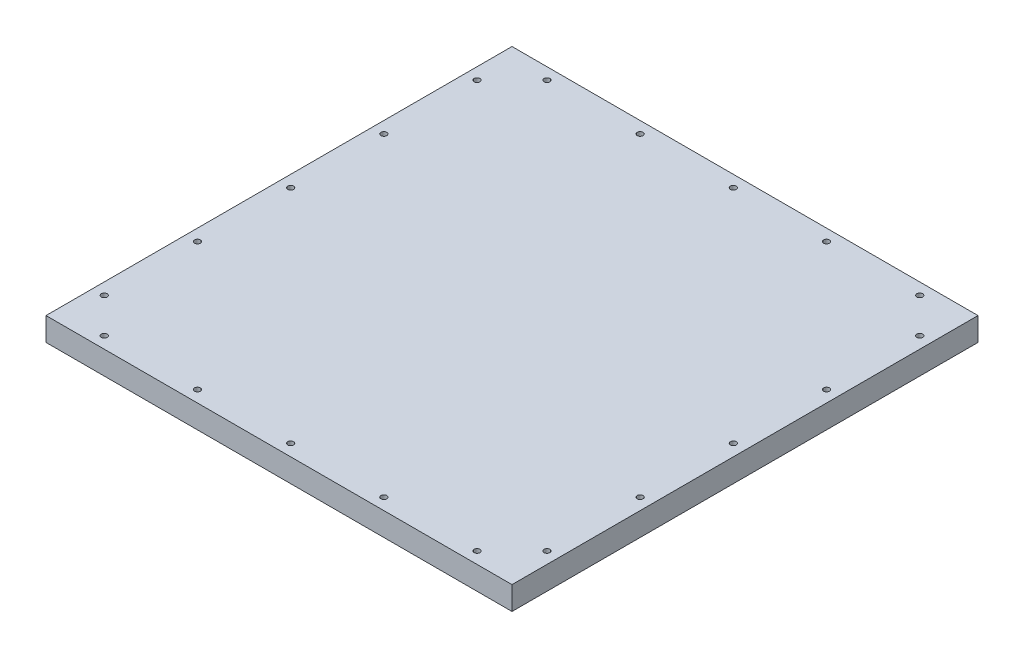
ISO-10303-21;
HEADER;
FILE_DESCRIPTION(('STEP AP214'),'2;1');
FILE_NAME('part.step','',(''),(''),'','','');
FILE_SCHEMA(('AUTOMOTIVE_DESIGN { 1 0 10303 214 1 1 1 1 }'));
ENDSEC;
DATA;
#1=APPLICATION_CONTEXT('core data for automotive mechanical design processes');
#2=APPLICATION_PROTOCOL_DEFINITION('international standard','automotive_design',2000,#1);
#3=PRODUCT_CONTEXT('',#1,'mechanical');
#4=PRODUCT('Part','Part','',(#3));
#5=PRODUCT_RELATED_PRODUCT_CATEGORY('part','',(#4));
#6=PRODUCT_DEFINITION_FORMATION('','',#4);
#7=PRODUCT_DEFINITION_CONTEXT('part definition',#1,'design');
#8=PRODUCT_DEFINITION('design','',#6,#7);
#9=PRODUCT_DEFINITION_SHAPE('','',#8);
#10=(LENGTH_UNIT() NAMED_UNIT(*) SI_UNIT(.MILLI.,.METRE.));
#11=(NAMED_UNIT(*) PLANE_ANGLE_UNIT() SI_UNIT($,.RADIAN.));
#12=(NAMED_UNIT(*) SI_UNIT($,.STERADIAN.) SOLID_ANGLE_UNIT());
#13=UNCERTAINTY_MEASURE_WITH_UNIT(LENGTH_MEASURE(1.E-05),#10,'distance_accuracy_value','');
#14=(GEOMETRIC_REPRESENTATION_CONTEXT(3) GLOBAL_UNCERTAINTY_ASSIGNED_CONTEXT((#13)) GLOBAL_UNIT_ASSIGNED_CONTEXT((#10,
#11,#12)) REPRESENTATION_CONTEXT('',''));
#15=CARTESIAN_POINT('',(0.,0.,0.));
#16=DIRECTION('',(0.,0.,1.));
#17=DIRECTION('',(1.,0.,0.));
#18=AXIS2_PLACEMENT_3D('',#15,#16,#17);
#19=CARTESIAN_POINT('',(0.,12.7,-254.));
#20=DIRECTION('',(0.,-1.,0.));
#21=DIRECTION('',(0.,0.,-1.));
#22=AXIS2_PLACEMENT_3D('',#19,#20,#21);
#23=PLANE('',#22);
#24=CARTESIAN_POINT('',(177.799999999999,12.7,-247.65));
#25=DIRECTION('',(0.,1.,0.));
#26=DIRECTION('',(0.,0.,1.));
#27=AXIS2_PLACEMENT_3D('',#24,#25,#26);
#28=CIRCLE('',#27,1.58749999999999);
#29=CARTESIAN_POINT('',(177.799999999999,12.7,-246.0625));
#30=VERTEX_POINT('',#29);
#31=EDGE_CURVE('E215',#30,#30,#28,.T.);
#32=ORIENTED_EDGE('',*,*,#31,.F.);
#33=EDGE_LOOP('',(#32));
#34=FACE_BOUND('',#33,.T.);
#35=CARTESIAN_POINT('',(76.1999999999992,12.7,-247.65));
#36=DIRECTION('',(0.,1.,0.));
#37=DIRECTION('',(0.,0.,1.));
#38=AXIS2_PLACEMENT_3D('',#35,#36,#37);
#39=CIRCLE('',#38,1.5875);
#40=CARTESIAN_POINT('',(76.1999999999992,12.7,-246.0625));
#41=VERTEX_POINT('',#40);
#42=EDGE_CURVE('E203',#41,#41,#39,.T.);
#43=ORIENTED_EDGE('',*,*,#42,.F.);
#44=EDGE_LOOP('',(#43));
#45=FACE_BOUND('',#44,.T.);
#46=CARTESIAN_POINT('',(228.6,12.7,-6.35));
#47=DIRECTION('',(0.,1.,0.));
#48=DIRECTION('',(0.,0.,1.));
#49=AXIS2_PLACEMENT_3D('',#46,#47,#48);
#50=CIRCLE('',#49,1.58749999999999);
#51=CARTESIAN_POINT('',(228.6,12.7,-4.76250000000001));
#52=VERTEX_POINT('',#51);
#53=EDGE_CURVE('E191',#52,#52,#50,.T.);
#54=ORIENTED_EDGE('',*,*,#53,.F.);
#55=EDGE_LOOP('',(#54));
#56=FACE_BOUND('',#55,.T.);
#57=CARTESIAN_POINT('',(127.,12.7,-6.35));
#58=DIRECTION('',(0.,1.,0.));
#59=DIRECTION('',(0.,0.,1.));
#60=AXIS2_PLACEMENT_3D('',#57,#58,#59);
#61=CIRCLE('',#60,1.58749999999999);
#62=CARTESIAN_POINT('',(127.,12.7,-4.76250000000001));
#63=VERTEX_POINT('',#62);
#64=EDGE_CURVE('E179',#63,#63,#61,.T.);
#65=ORIENTED_EDGE('',*,*,#64,.F.);
#66=EDGE_LOOP('',(#65));
#67=FACE_BOUND('',#66,.T.);
#68=CARTESIAN_POINT('',(247.649999999999,12.7,-228.6));
#69=DIRECTION('',(0.,1.,0.));
#70=DIRECTION('',(0.,0.,1.));
#71=AXIS2_PLACEMENT_3D('',#68,#69,#70);
#72=CIRCLE('',#71,1.58750000000001);
#73=CARTESIAN_POINT('',(247.649999999999,12.7,-227.0125));
#74=VERTEX_POINT('',#73);
#75=EDGE_CURVE('E167',#74,#74,#72,.T.);
#76=ORIENTED_EDGE('',*,*,#75,.F.);
#77=EDGE_LOOP('',(#76));
#78=FACE_BOUND('',#77,.T.);
#79=CARTESIAN_POINT('',(247.649999999999,12.7,-177.8));
#80=DIRECTION('',(0.,1.,0.));
#81=DIRECTION('',(0.,0.,1.));
#82=AXIS2_PLACEMENT_3D('',#79,#80,#81);
#83=CIRCLE('',#82,1.58750000000001);
#84=CARTESIAN_POINT('',(247.649999999999,12.7,-176.2125));
#85=VERTEX_POINT('',#84);
#86=EDGE_CURVE('E155',#85,#85,#83,.T.);
#87=ORIENTED_EDGE('',*,*,#86,.F.);
#88=EDGE_LOOP('',(#87));
#89=FACE_BOUND('',#88,.T.);
#90=CARTESIAN_POINT('',(247.65,12.7,-127.));
#91=DIRECTION('',(0.,1.,0.));
#92=DIRECTION('',(0.,0.,1.));
#93=AXIS2_PLACEMENT_3D('',#90,#91,#92);
#94=CIRCLE('',#93,1.58750000000001);
#95=CARTESIAN_POINT('',(247.65,12.7,-125.4125));
#96=VERTEX_POINT('',#95);
#97=EDGE_CURVE('E143',#96,#96,#94,.T.);
#98=ORIENTED_EDGE('',*,*,#97,.F.);
#99=EDGE_LOOP('',(#98));
#100=FACE_BOUND('',#99,.T.);
#101=CARTESIAN_POINT('',(247.65,12.7,-76.2));
#102=DIRECTION('',(0.,1.,0.));
#103=DIRECTION('',(0.,0.,1.));
#104=AXIS2_PLACEMENT_3D('',#101,#102,#103);
#105=CIRCLE('',#104,1.58750000000001);
#106=CARTESIAN_POINT('',(247.65,12.7,-74.6125));
#107=VERTEX_POINT('',#106);
#108=EDGE_CURVE('E131',#107,#107,#105,.T.);
#109=ORIENTED_EDGE('',*,*,#108,.F.);
#110=EDGE_LOOP('',(#109));
#111=FACE_BOUND('',#110,.T.);
#112=CARTESIAN_POINT('',(247.65,12.7,-25.4));
#113=DIRECTION('',(0.,1.,0.));
#114=DIRECTION('',(0.,0.,1.));
#115=AXIS2_PLACEMENT_3D('',#112,#113,#114);
#116=CIRCLE('',#115,1.58750000000001);
#117=CARTESIAN_POINT('',(247.65,12.7,-23.8125));
#118=VERTEX_POINT('',#117);
#119=EDGE_CURVE('E119',#118,#118,#116,.T.);
#120=ORIENTED_EDGE('',*,*,#119,.F.);
#121=EDGE_LOOP('',(#120));
#122=FACE_BOUND('',#121,.T.);
#123=CARTESIAN_POINT('',(6.35,12.7,-25.4));
#124=DIRECTION('',(0.,1.,0.));
#125=DIRECTION('',(0.,0.,1.));
#126=AXIS2_PLACEMENT_3D('',#123,#124,#125);
#127=CIRCLE('',#126,1.5875);
#128=CARTESIAN_POINT('',(6.35,12.7,-23.8125));
#129=VERTEX_POINT('',#128);
#130=EDGE_CURVE('E98',#129,#129,#127,.T.);
#131=ORIENTED_EDGE('',*,*,#130,.F.);
#132=EDGE_LOOP('',(#131));
#133=FACE_BOUND('',#132,.T.);
#134=DIRECTION('',(0.,0.,1.));
#135=VECTOR('',#134,1.);
#136=CARTESIAN_POINT('',(0.,12.7,0.));
#137=LINE('',#136,#135);
#138=CARTESIAN_POINT('',(0.,12.7,-254.));
#139=VERTEX_POINT('',#138);
#140=CARTESIAN_POINT('',(0.,12.7,0.));
#141=VERTEX_POINT('',#140);
#142=EDGE_CURVE('E83',#139,#141,#137,.T.);
#143=ORIENTED_EDGE('',*,*,#142,.T.);
#144=DIRECTION('',(1.,0.,0.));
#145=VECTOR('',#144,1.);
#146=CARTESIAN_POINT('',(0.,12.7,0.));
#147=LINE('',#146,#145);
#148=CARTESIAN_POINT('',(254.,12.7,0.));
#149=VERTEX_POINT('',#148);
#150=EDGE_CURVE('E78',#141,#149,#147,.T.);
#151=ORIENTED_EDGE('',*,*,#150,.T.);
#152=DIRECTION('',(0.,0.,-1.));
#153=VECTOR('',#152,1.);
#154=CARTESIAN_POINT('',(254.,12.7,0.));
#155=LINE('',#154,#153);
#156=CARTESIAN_POINT('',(254.,12.7,-254.));
#157=VERTEX_POINT('',#156);
#158=EDGE_CURVE('E81',#149,#157,#155,.T.);
#159=ORIENTED_EDGE('',*,*,#158,.T.);
#160=DIRECTION('',(-1.,0.,0.));
#161=VECTOR('',#160,1.);
#162=CARTESIAN_POINT('',(0.,12.7,-254.));
#163=LINE('',#162,#161);
#164=EDGE_CURVE('E48',#157,#139,#163,.T.);
#165=ORIENTED_EDGE('',*,*,#164,.T.);
#166=EDGE_LOOP('',(#143,#151,#159,#165));
#167=FACE_BOUND('',#166,.T.);
#168=CARTESIAN_POINT('',(25.4,12.7,-6.35));
#169=DIRECTION('',(0.,1.,0.));
#170=DIRECTION('',(0.,0.,1.));
#171=AXIS2_PLACEMENT_3D('',#168,#169,#170);
#172=CIRCLE('',#171,1.5875);
#173=CARTESIAN_POINT('',(25.4,12.7,-4.7625));
#174=VERTEX_POINT('',#173);
#175=EDGE_CURVE('E113',#174,#174,#172,.T.);
#176=ORIENTED_EDGE('',*,*,#175,.F.);
#177=EDGE_LOOP('',(#176));
#178=FACE_BOUND('',#177,.T.);
#179=CARTESIAN_POINT('',(6.34999999999982,12.7,-76.2));
#180=DIRECTION('',(0.,1.,0.));
#181=DIRECTION('',(0.,0.,1.));
#182=AXIS2_PLACEMENT_3D('',#179,#180,#181);
#183=CIRCLE('',#182,1.5875);
#184=CARTESIAN_POINT('',(6.34999999999982,12.7,-74.6125));
#185=VERTEX_POINT('',#184);
#186=EDGE_CURVE('E125',#185,#185,#183,.T.);
#187=ORIENTED_EDGE('',*,*,#186,.F.);
#188=EDGE_LOOP('',(#187));
#189=FACE_BOUND('',#188,.T.);
#190=CARTESIAN_POINT('',(6.34999999999965,12.7,-127.));
#191=DIRECTION('',(0.,1.,0.));
#192=DIRECTION('',(0.,0.,1.));
#193=AXIS2_PLACEMENT_3D('',#190,#191,#192);
#194=CIRCLE('',#193,1.5875);
#195=CARTESIAN_POINT('',(6.34999999999965,12.7,-125.4125));
#196=VERTEX_POINT('',#195);
#197=EDGE_CURVE('E137',#196,#196,#194,.T.);
#198=ORIENTED_EDGE('',*,*,#197,.F.);
#199=EDGE_LOOP('',(#198));
#200=FACE_BOUND('',#199,.T.);
#201=CARTESIAN_POINT('',(6.34999999999947,12.7,-177.8));
#202=DIRECTION('',(0.,1.,0.));
#203=DIRECTION('',(0.,0.,1.));
#204=AXIS2_PLACEMENT_3D('',#201,#202,#203);
#205=CIRCLE('',#204,1.5875);
#206=CARTESIAN_POINT('',(6.34999999999947,12.7,-176.2125));
#207=VERTEX_POINT('',#206);
#208=EDGE_CURVE('E149',#207,#207,#205,.T.);
#209=ORIENTED_EDGE('',*,*,#208,.F.);
#210=EDGE_LOOP('',(#209));
#211=FACE_BOUND('',#210,.T.);
#212=CARTESIAN_POINT('',(6.34999999999929,12.7,-228.6));
#213=DIRECTION('',(0.,1.,0.));
#214=DIRECTION('',(0.,0.,1.));
#215=AXIS2_PLACEMENT_3D('',#212,#213,#214);
#216=CIRCLE('',#215,1.5875);
#217=CARTESIAN_POINT('',(6.34999999999929,12.7,-227.0125));
#218=VERTEX_POINT('',#217);
#219=EDGE_CURVE('E161',#218,#218,#216,.T.);
#220=ORIENTED_EDGE('',*,*,#219,.F.);
#221=EDGE_LOOP('',(#220));
#222=FACE_BOUND('',#221,.T.);
#223=CARTESIAN_POINT('',(76.2,12.7,-6.35));
#224=DIRECTION('',(0.,1.,0.));
#225=DIRECTION('',(0.,0.,1.));
#226=AXIS2_PLACEMENT_3D('',#223,#224,#225);
#227=CIRCLE('',#226,1.58750000000001);
#228=CARTESIAN_POINT('',(76.2,12.7,-4.76249999999999));
#229=VERTEX_POINT('',#228);
#230=EDGE_CURVE('E173',#229,#229,#227,.T.);
#231=ORIENTED_EDGE('',*,*,#230,.F.);
#232=EDGE_LOOP('',(#231));
#233=FACE_BOUND('',#232,.T.);
#234=CARTESIAN_POINT('',(177.8,12.7,-6.35));
#235=DIRECTION('',(0.,1.,0.));
#236=DIRECTION('',(0.,0.,1.));
#237=AXIS2_PLACEMENT_3D('',#234,#235,#236);
#238=CIRCLE('',#237,1.58749999999999);
#239=CARTESIAN_POINT('',(177.8,12.7,-4.76250000000001));
#240=VERTEX_POINT('',#239);
#241=EDGE_CURVE('E185',#240,#240,#238,.T.);
#242=ORIENTED_EDGE('',*,*,#241,.F.);
#243=EDGE_LOOP('',(#242));
#244=FACE_BOUND('',#243,.T.);
#245=CARTESIAN_POINT('',(25.3999999999992,12.7,-247.65));
#246=DIRECTION('',(0.,1.,0.));
#247=DIRECTION('',(0.,0.,1.));
#248=AXIS2_PLACEMENT_3D('',#245,#246,#247);
#249=CIRCLE('',#248,1.5875);
#250=CARTESIAN_POINT('',(25.3999999999992,12.7,-246.0625));
#251=VERTEX_POINT('',#250);
#252=EDGE_CURVE('E197',#251,#251,#249,.T.);
#253=ORIENTED_EDGE('',*,*,#252,.F.);
#254=EDGE_LOOP('',(#253));
#255=FACE_BOUND('',#254,.T.);
#256=CARTESIAN_POINT('',(126.999999999999,12.7,-247.65));
#257=DIRECTION('',(0.,1.,0.));
#258=DIRECTION('',(0.,0.,1.));
#259=AXIS2_PLACEMENT_3D('',#256,#257,#258);
#260=CIRCLE('',#259,1.58750000000001);
#261=CARTESIAN_POINT('',(126.999999999999,12.7,-246.0625));
#262=VERTEX_POINT('',#261);
#263=EDGE_CURVE('E209',#262,#262,#260,.T.);
#264=ORIENTED_EDGE('',*,*,#263,.F.);
#265=EDGE_LOOP('',(#264));
#266=FACE_BOUND('',#265,.T.);
#267=CARTESIAN_POINT('',(228.599999999999,12.7,-247.65));
#268=DIRECTION('',(0.,1.,0.));
#269=DIRECTION('',(0.,0.,1.));
#270=AXIS2_PLACEMENT_3D('',#267,#268,#269);
#271=CIRCLE('',#270,1.58749999999999);
#272=CARTESIAN_POINT('',(228.599999999999,12.7,-246.0625));
#273=VERTEX_POINT('',#272);
#274=EDGE_CURVE('E221',#273,#273,#271,.T.);
#275=ORIENTED_EDGE('',*,*,#274,.F.);
#276=EDGE_LOOP('',(#275));
#277=FACE_BOUND('',#276,.T.);
#278=ADVANCED_FACE('F31',(#34,#45,#56,#67,#78,#89,#100,#111,#122,#133,#167,#178,#189,#200,#211,
#222,#233,#244,#255,#266,#277),#23,.F.);
#279=CARTESIAN_POINT('',(0.,0.,-254.));
#280=DIRECTION('',(0.,-1.,0.));
#281=DIRECTION('',(0.,0.,-1.));
#282=AXIS2_PLACEMENT_3D('',#279,#280,#281);
#283=PLANE('',#282);
#284=CARTESIAN_POINT('',(177.799999999999,0.,-247.65));
#285=DIRECTION('',(0.,1.,0.));
#286=DIRECTION('',(0.,0.,1.));
#287=AXIS2_PLACEMENT_3D('',#284,#285,#286);
#288=CIRCLE('',#287,1.58749999999999);
#289=CARTESIAN_POINT('',(177.799999999999,0.,-246.0625));
#290=VERTEX_POINT('',#289);
#291=EDGE_CURVE('E218',#290,#290,#288,.T.);
#292=ORIENTED_EDGE('',*,*,#291,.T.);
#293=EDGE_LOOP('',(#292));
#294=FACE_BOUND('',#293,.T.);
#295=CARTESIAN_POINT('',(76.1999999999992,0.,-247.65));
#296=DIRECTION('',(0.,1.,0.));
#297=DIRECTION('',(0.,0.,1.));
#298=AXIS2_PLACEMENT_3D('',#295,#296,#297);
#299=CIRCLE('',#298,1.5875);
#300=CARTESIAN_POINT('',(76.1999999999992,0.,-246.0625));
#301=VERTEX_POINT('',#300);
#302=EDGE_CURVE('E206',#301,#301,#299,.T.);
#303=ORIENTED_EDGE('',*,*,#302,.T.);
#304=EDGE_LOOP('',(#303));
#305=FACE_BOUND('',#304,.T.);
#306=CARTESIAN_POINT('',(228.6,0.,-6.35));
#307=DIRECTION('',(0.,1.,0.));
#308=DIRECTION('',(0.,0.,1.));
#309=AXIS2_PLACEMENT_3D('',#306,#307,#308);
#310=CIRCLE('',#309,1.58749999999999);
#311=CARTESIAN_POINT('',(228.6,0.,-4.76250000000001));
#312=VERTEX_POINT('',#311);
#313=EDGE_CURVE('E194',#312,#312,#310,.T.);
#314=ORIENTED_EDGE('',*,*,#313,.T.);
#315=EDGE_LOOP('',(#314));
#316=FACE_BOUND('',#315,.T.);
#317=CARTESIAN_POINT('',(127.,0.,-6.35));
#318=DIRECTION('',(0.,1.,0.));
#319=DIRECTION('',(0.,0.,1.));
#320=AXIS2_PLACEMENT_3D('',#317,#318,#319);
#321=CIRCLE('',#320,1.58749999999999);
#322=CARTESIAN_POINT('',(127.,0.,-4.76250000000001));
#323=VERTEX_POINT('',#322);
#324=EDGE_CURVE('E182',#323,#323,#321,.T.);
#325=ORIENTED_EDGE('',*,*,#324,.T.);
#326=EDGE_LOOP('',(#325));
#327=FACE_BOUND('',#326,.T.);
#328=CARTESIAN_POINT('',(247.649999999999,0.,-228.6));
#329=DIRECTION('',(0.,1.,0.));
#330=DIRECTION('',(0.,0.,1.));
#331=AXIS2_PLACEMENT_3D('',#328,#329,#330);
#332=CIRCLE('',#331,1.58750000000001);
#333=CARTESIAN_POINT('',(247.649999999999,0.,-227.0125));
#334=VERTEX_POINT('',#333);
#335=EDGE_CURVE('E170',#334,#334,#332,.T.);
#336=ORIENTED_EDGE('',*,*,#335,.T.);
#337=EDGE_LOOP('',(#336));
#338=FACE_BOUND('',#337,.T.);
#339=CARTESIAN_POINT('',(247.649999999999,0.,-177.8));
#340=DIRECTION('',(0.,1.,0.));
#341=DIRECTION('',(0.,0.,1.));
#342=AXIS2_PLACEMENT_3D('',#339,#340,#341);
#343=CIRCLE('',#342,1.58750000000001);
#344=CARTESIAN_POINT('',(247.649999999999,0.,-176.2125));
#345=VERTEX_POINT('',#344);
#346=EDGE_CURVE('E158',#345,#345,#343,.T.);
#347=ORIENTED_EDGE('',*,*,#346,.T.);
#348=EDGE_LOOP('',(#347));
#349=FACE_BOUND('',#348,.T.);
#350=CARTESIAN_POINT('',(247.65,0.,-127.));
#351=DIRECTION('',(0.,1.,0.));
#352=DIRECTION('',(0.,0.,1.));
#353=AXIS2_PLACEMENT_3D('',#350,#351,#352);
#354=CIRCLE('',#353,1.58750000000001);
#355=CARTESIAN_POINT('',(247.65,0.,-125.4125));
#356=VERTEX_POINT('',#355);
#357=EDGE_CURVE('E146',#356,#356,#354,.T.);
#358=ORIENTED_EDGE('',*,*,#357,.T.);
#359=EDGE_LOOP('',(#358));
#360=FACE_BOUND('',#359,.T.);
#361=CARTESIAN_POINT('',(247.65,0.,-76.2));
#362=DIRECTION('',(0.,1.,0.));
#363=DIRECTION('',(0.,0.,1.));
#364=AXIS2_PLACEMENT_3D('',#361,#362,#363);
#365=CIRCLE('',#364,1.58750000000001);
#366=CARTESIAN_POINT('',(247.65,0.,-74.6125));
#367=VERTEX_POINT('',#366);
#368=EDGE_CURVE('E134',#367,#367,#365,.T.);
#369=ORIENTED_EDGE('',*,*,#368,.T.);
#370=EDGE_LOOP('',(#369));
#371=FACE_BOUND('',#370,.T.);
#372=CARTESIAN_POINT('',(247.65,0.,-25.4));
#373=DIRECTION('',(0.,1.,0.));
#374=DIRECTION('',(0.,0.,1.));
#375=AXIS2_PLACEMENT_3D('',#372,#373,#374);
#376=CIRCLE('',#375,1.58750000000001);
#377=CARTESIAN_POINT('',(247.65,0.,-23.8125));
#378=VERTEX_POINT('',#377);
#379=EDGE_CURVE('E122',#378,#378,#376,.T.);
#380=ORIENTED_EDGE('',*,*,#379,.T.);
#381=EDGE_LOOP('',(#380));
#382=FACE_BOUND('',#381,.T.);
#383=CARTESIAN_POINT('',(6.35,0.,-25.4));
#384=DIRECTION('',(0.,1.,0.));
#385=DIRECTION('',(0.,0.,1.));
#386=AXIS2_PLACEMENT_3D('',#383,#384,#385);
#387=CIRCLE('',#386,1.5875);
#388=CARTESIAN_POINT('',(6.35,0.,-23.8125));
#389=VERTEX_POINT('',#388);
#390=EDGE_CURVE('E110',#389,#389,#387,.T.);
#391=ORIENTED_EDGE('',*,*,#390,.T.);
#392=EDGE_LOOP('',(#391));
#393=FACE_BOUND('',#392,.T.);
#394=DIRECTION('',(0.,0.,1.));
#395=VECTOR('',#394,1.);
#396=CARTESIAN_POINT('',(0.,0.,0.));
#397=LINE('',#396,#395);
#398=CARTESIAN_POINT('',(0.,0.,-254.));
#399=VERTEX_POINT('',#398);
#400=CARTESIAN_POINT('',(0.,0.,0.));
#401=VERTEX_POINT('',#400);
#402=EDGE_CURVE('E95',#399,#401,#397,.T.);
#403=ORIENTED_EDGE('',*,*,#402,.F.);
#404=DIRECTION('',(-1.,0.,0.));
#405=VECTOR('',#404,1.);
#406=CARTESIAN_POINT('',(0.,0.,-254.));
#407=LINE('',#406,#405);
#408=CARTESIAN_POINT('',(254.,0.,-254.));
#409=VERTEX_POINT('',#408);
#410=EDGE_CURVE('E71',#409,#399,#407,.T.);
#411=ORIENTED_EDGE('',*,*,#410,.F.);
#412=DIRECTION('',(0.,0.,-1.));
#413=VECTOR('',#412,1.);
#414=CARTESIAN_POINT('',(254.,0.,0.));
#415=LINE('',#414,#413);
#416=CARTESIAN_POINT('',(254.,0.,0.));
#417=VERTEX_POINT('',#416);
#418=EDGE_CURVE('E65',#417,#409,#415,.T.);
#419=ORIENTED_EDGE('',*,*,#418,.F.);
#420=DIRECTION('',(1.,0.,0.));
#421=VECTOR('',#420,1.);
#422=CARTESIAN_POINT('',(0.,0.,0.));
#423=LINE('',#422,#421);
#424=EDGE_CURVE('E87',#401,#417,#423,.T.);
#425=ORIENTED_EDGE('',*,*,#424,.F.);
#426=EDGE_LOOP('',(#403,#411,#419,#425));
#427=FACE_BOUND('',#426,.T.);
#428=CARTESIAN_POINT('',(25.4,0.,-6.35));
#429=DIRECTION('',(0.,1.,0.));
#430=DIRECTION('',(0.,0.,1.));
#431=AXIS2_PLACEMENT_3D('',#428,#429,#430);
#432=CIRCLE('',#431,1.5875);
#433=CARTESIAN_POINT('',(25.4,0.,-4.7625));
#434=VERTEX_POINT('',#433);
#435=EDGE_CURVE('E116',#434,#434,#432,.T.);
#436=ORIENTED_EDGE('',*,*,#435,.T.);
#437=EDGE_LOOP('',(#436));
#438=FACE_BOUND('',#437,.T.);
#439=CARTESIAN_POINT('',(6.34999999999982,0.,-76.2));
#440=DIRECTION('',(0.,1.,0.));
#441=DIRECTION('',(0.,0.,1.));
#442=AXIS2_PLACEMENT_3D('',#439,#440,#441);
#443=CIRCLE('',#442,1.5875);
#444=CARTESIAN_POINT('',(6.34999999999982,0.,-74.6125));
#445=VERTEX_POINT('',#444);
#446=EDGE_CURVE('E128',#445,#445,#443,.T.);
#447=ORIENTED_EDGE('',*,*,#446,.T.);
#448=EDGE_LOOP('',(#447));
#449=FACE_BOUND('',#448,.T.);
#450=CARTESIAN_POINT('',(6.34999999999965,0.,-127.));
#451=DIRECTION('',(0.,1.,0.));
#452=DIRECTION('',(0.,0.,1.));
#453=AXIS2_PLACEMENT_3D('',#450,#451,#452);
#454=CIRCLE('',#453,1.5875);
#455=CARTESIAN_POINT('',(6.34999999999965,0.,-125.4125));
#456=VERTEX_POINT('',#455);
#457=EDGE_CURVE('E140',#456,#456,#454,.T.);
#458=ORIENTED_EDGE('',*,*,#457,.T.);
#459=EDGE_LOOP('',(#458));
#460=FACE_BOUND('',#459,.T.);
#461=CARTESIAN_POINT('',(6.34999999999947,0.,-177.8));
#462=DIRECTION('',(0.,1.,0.));
#463=DIRECTION('',(0.,0.,1.));
#464=AXIS2_PLACEMENT_3D('',#461,#462,#463);
#465=CIRCLE('',#464,1.5875);
#466=CARTESIAN_POINT('',(6.34999999999947,0.,-176.2125));
#467=VERTEX_POINT('',#466);
#468=EDGE_CURVE('E152',#467,#467,#465,.T.);
#469=ORIENTED_EDGE('',*,*,#468,.T.);
#470=EDGE_LOOP('',(#469));
#471=FACE_BOUND('',#470,.T.);
#472=CARTESIAN_POINT('',(6.34999999999929,0.,-228.6));
#473=DIRECTION('',(0.,1.,0.));
#474=DIRECTION('',(0.,0.,1.));
#475=AXIS2_PLACEMENT_3D('',#472,#473,#474);
#476=CIRCLE('',#475,1.5875);
#477=CARTESIAN_POINT('',(6.34999999999929,0.,-227.0125));
#478=VERTEX_POINT('',#477);
#479=EDGE_CURVE('E164',#478,#478,#476,.T.);
#480=ORIENTED_EDGE('',*,*,#479,.T.);
#481=EDGE_LOOP('',(#480));
#482=FACE_BOUND('',#481,.T.);
#483=CARTESIAN_POINT('',(76.2,0.,-6.35));
#484=DIRECTION('',(0.,1.,0.));
#485=DIRECTION('',(0.,0.,1.));
#486=AXIS2_PLACEMENT_3D('',#483,#484,#485);
#487=CIRCLE('',#486,1.58750000000001);
#488=CARTESIAN_POINT('',(76.2,0.,-4.76249999999999));
#489=VERTEX_POINT('',#488);
#490=EDGE_CURVE('E176',#489,#489,#487,.T.);
#491=ORIENTED_EDGE('',*,*,#490,.T.);
#492=EDGE_LOOP('',(#491));
#493=FACE_BOUND('',#492,.T.);
#494=CARTESIAN_POINT('',(177.8,0.,-6.35));
#495=DIRECTION('',(0.,1.,0.));
#496=DIRECTION('',(0.,0.,1.));
#497=AXIS2_PLACEMENT_3D('',#494,#495,#496);
#498=CIRCLE('',#497,1.58749999999999);
#499=CARTESIAN_POINT('',(177.8,0.,-4.76250000000001));
#500=VERTEX_POINT('',#499);
#501=EDGE_CURVE('E188',#500,#500,#498,.T.);
#502=ORIENTED_EDGE('',*,*,#501,.T.);
#503=EDGE_LOOP('',(#502));
#504=FACE_BOUND('',#503,.T.);
#505=CARTESIAN_POINT('',(25.3999999999992,0.,-247.65));
#506=DIRECTION('',(0.,1.,0.));
#507=DIRECTION('',(0.,0.,1.));
#508=AXIS2_PLACEMENT_3D('',#505,#506,#507);
#509=CIRCLE('',#508,1.5875);
#510=CARTESIAN_POINT('',(25.3999999999992,0.,-246.0625));
#511=VERTEX_POINT('',#510);
#512=EDGE_CURVE('E200',#511,#511,#509,.T.);
#513=ORIENTED_EDGE('',*,*,#512,.T.);
#514=EDGE_LOOP('',(#513));
#515=FACE_BOUND('',#514,.T.);
#516=CARTESIAN_POINT('',(126.999999999999,0.,-247.65));
#517=DIRECTION('',(0.,1.,0.));
#518=DIRECTION('',(0.,0.,1.));
#519=AXIS2_PLACEMENT_3D('',#516,#517,#518);
#520=CIRCLE('',#519,1.58750000000001);
#521=CARTESIAN_POINT('',(126.999999999999,0.,-246.0625));
#522=VERTEX_POINT('',#521);
#523=EDGE_CURVE('E212',#522,#522,#520,.T.);
#524=ORIENTED_EDGE('',*,*,#523,.T.);
#525=EDGE_LOOP('',(#524));
#526=FACE_BOUND('',#525,.T.);
#527=CARTESIAN_POINT('',(228.599999999999,0.,-247.65));
#528=DIRECTION('',(0.,1.,0.));
#529=DIRECTION('',(0.,0.,1.));
#530=AXIS2_PLACEMENT_3D('',#527,#528,#529);
#531=CIRCLE('',#530,1.58749999999999);
#532=CARTESIAN_POINT('',(228.599999999999,0.,-246.0625));
#533=VERTEX_POINT('',#532);
#534=EDGE_CURVE('E224',#533,#533,#531,.T.);
#535=ORIENTED_EDGE('',*,*,#534,.T.);
#536=EDGE_LOOP('',(#535));
#537=FACE_BOUND('',#536,.T.);
#538=ADVANCED_FACE('F106',(#294,#305,#316,#327,#338,#349,#360,#371,#382,#393,#427,#438,#449,
#460,#471,#482,#493,#504,#515,#526,#537),#283,.T.);
#539=CARTESIAN_POINT('',(0.,12.7,0.));
#540=DIRECTION('',(1.,0.,0.));
#541=DIRECTION('',(0.,0.,-1.));
#542=AXIS2_PLACEMENT_3D('',#539,#540,#541);
#543=PLANE('',#542);
#544=ORIENTED_EDGE('',*,*,#402,.T.);
#545=DIRECTION('',(0.,-1.,0.));
#546=VECTOR('',#545,1.);
#547=CARTESIAN_POINT('',(0.,12.7,0.));
#548=LINE('',#547,#546);
#549=EDGE_CURVE('E11',#141,#401,#548,.T.);
#550=ORIENTED_EDGE('',*,*,#549,.F.);
#551=ORIENTED_EDGE('',*,*,#142,.F.);
#552=DIRECTION('',(0.,-1.,0.));
#553=VECTOR('',#552,1.);
#554=CARTESIAN_POINT('',(0.,12.7,-254.));
#555=LINE('',#554,#553);
#556=EDGE_CURVE('E91',#139,#399,#555,.T.);
#557=ORIENTED_EDGE('',*,*,#556,.T.);
#558=EDGE_LOOP('',(#544,#550,#551,#557));
#559=FACE_BOUND('',#558,.T.);
#560=ADVANCED_FACE('F33',(#559),#543,.F.);
#561=CARTESIAN_POINT('',(0.,12.7,0.));
#562=DIRECTION('',(0.,0.,-1.));
#563=DIRECTION('',(-1.,0.,0.));
#564=AXIS2_PLACEMENT_3D('',#561,#562,#563);
#565=PLANE('',#564);
#566=ORIENTED_EDGE('',*,*,#424,.T.);
#567=DIRECTION('',(0.,-1.,0.));
#568=VECTOR('',#567,1.);
#569=CARTESIAN_POINT('',(254.,12.7,0.));
#570=LINE('',#569,#568);
#571=EDGE_CURVE('E40',#149,#417,#570,.T.);
#572=ORIENTED_EDGE('',*,*,#571,.F.);
#573=ORIENTED_EDGE('',*,*,#150,.F.);
#574=ORIENTED_EDGE('',*,*,#549,.T.);
#575=EDGE_LOOP('',(#566,#572,#573,#574));
#576=FACE_BOUND('',#575,.T.);
#577=ADVANCED_FACE('F86',(#576),#565,.F.);
#578=CARTESIAN_POINT('',(254.,12.7,0.));
#579=DIRECTION('',(-1.,0.,0.));
#580=DIRECTION('',(0.,0.,1.));
#581=AXIS2_PLACEMENT_3D('',#578,#579,#580);
#582=PLANE('',#581);
#583=ORIENTED_EDGE('',*,*,#418,.T.);
#584=DIRECTION('',(0.,-1.,0.));
#585=VECTOR('',#584,1.);
#586=CARTESIAN_POINT('',(254.,12.7,-254.));
#587=LINE('',#586,#585);
#588=EDGE_CURVE('E88',#157,#409,#587,.T.);
#589=ORIENTED_EDGE('',*,*,#588,.F.);
#590=ORIENTED_EDGE('',*,*,#158,.F.);
#591=ORIENTED_EDGE('',*,*,#571,.T.);
#592=EDGE_LOOP('',(#583,#589,#590,#591));
#593=FACE_BOUND('',#592,.T.);
#594=ADVANCED_FACE('F89',(#593),#582,.F.);
#595=CARTESIAN_POINT('',(0.,12.7,-254.));
#596=DIRECTION('',(0.,0.,1.));
#597=DIRECTION('',(1.,0.,0.));
#598=AXIS2_PLACEMENT_3D('',#595,#596,#597);
#599=PLANE('',#598);
#600=ORIENTED_EDGE('',*,*,#410,.T.);
#601=ORIENTED_EDGE('',*,*,#556,.F.);
#602=ORIENTED_EDGE('',*,*,#164,.F.);
#603=ORIENTED_EDGE('',*,*,#588,.T.);
#604=EDGE_LOOP('',(#600,#601,#602,#603));
#605=FACE_BOUND('',#604,.T.);
#606=ADVANCED_FACE('F103',(#605),#599,.F.);
#607=CARTESIAN_POINT('',(6.35,12.7,-25.4));
#608=DIRECTION('',(0.,-1.,0.));
#609=DIRECTION('',(0.,0.,-1.));
#610=AXIS2_PLACEMENT_3D('',#607,#608,#609);
#611=CYLINDRICAL_SURFACE('',#610,1.5875);
#612=ORIENTED_EDGE('',*,*,#130,.T.);
#613=EDGE_LOOP('',(#612));
#614=FACE_BOUND('',#613,.T.);
#615=ORIENTED_EDGE('',*,*,#390,.F.);
#616=EDGE_LOOP('',(#615));
#617=FACE_BOUND('',#616,.T.);
#618=ADVANCED_FACE('F244',(#614,#617),#611,.F.);
#619=CARTESIAN_POINT('',(25.4,12.7,-6.35));
#620=DIRECTION('',(0.,-1.,0.));
#621=DIRECTION('',(0.,0.,-1.));
#622=AXIS2_PLACEMENT_3D('',#619,#620,#621);
#623=CYLINDRICAL_SURFACE('',#622,1.5875);
#624=ORIENTED_EDGE('',*,*,#175,.T.);
#625=EDGE_LOOP('',(#624));
#626=FACE_BOUND('',#625,.T.);
#627=ORIENTED_EDGE('',*,*,#435,.F.);
#628=EDGE_LOOP('',(#627));
#629=FACE_BOUND('',#628,.T.);
#630=ADVANCED_FACE('F290',(#626,#629),#623,.F.);
#631=CARTESIAN_POINT('',(247.65,12.7,-25.4));
#632=DIRECTION('',(0.,-1.,0.));
#633=DIRECTION('',(0.,0.,-1.));
#634=AXIS2_PLACEMENT_3D('',#631,#632,#633);
#635=CYLINDRICAL_SURFACE('',#634,1.58750000000001);
#636=ORIENTED_EDGE('',*,*,#119,.T.);
#637=EDGE_LOOP('',(#636));
#638=FACE_BOUND('',#637,.T.);
#639=ORIENTED_EDGE('',*,*,#379,.F.);
#640=EDGE_LOOP('',(#639));
#641=FACE_BOUND('',#640,.T.);
#642=ADVANCED_FACE('F298',(#638,#641),#635,.F.);
#643=CARTESIAN_POINT('',(6.34999999999982,12.7,-76.2));
#644=DIRECTION('',(0.,-1.,0.));
#645=DIRECTION('',(0.,0.,-1.));
#646=AXIS2_PLACEMENT_3D('',#643,#644,#645);
#647=CYLINDRICAL_SURFACE('',#646,1.5875);
#648=ORIENTED_EDGE('',*,*,#186,.T.);
#649=EDGE_LOOP('',(#648));
#650=FACE_BOUND('',#649,.T.);
#651=ORIENTED_EDGE('',*,*,#446,.F.);
#652=EDGE_LOOP('',(#651));
#653=FACE_BOUND('',#652,.T.);
#654=ADVANCED_FACE('F306',(#650,#653),#647,.F.);
#655=CARTESIAN_POINT('',(247.65,12.7,-76.2));
#656=DIRECTION('',(0.,-1.,0.));
#657=DIRECTION('',(0.,0.,-1.));
#658=AXIS2_PLACEMENT_3D('',#655,#656,#657);
#659=CYLINDRICAL_SURFACE('',#658,1.58750000000001);
#660=ORIENTED_EDGE('',*,*,#108,.T.);
#661=EDGE_LOOP('',(#660));
#662=FACE_BOUND('',#661,.T.);
#663=ORIENTED_EDGE('',*,*,#368,.F.);
#664=EDGE_LOOP('',(#663));
#665=FACE_BOUND('',#664,.T.);
#666=ADVANCED_FACE('F315',(#662,#665),#659,.F.);
#667=CARTESIAN_POINT('',(6.34999999999965,12.7,-127.));
#668=DIRECTION('',(0.,-1.,0.));
#669=DIRECTION('',(0.,0.,-1.));
#670=AXIS2_PLACEMENT_3D('',#667,#668,#669);
#671=CYLINDRICAL_SURFACE('',#670,1.5875);
#672=ORIENTED_EDGE('',*,*,#197,.T.);
#673=EDGE_LOOP('',(#672));
#674=FACE_BOUND('',#673,.T.);
#675=ORIENTED_EDGE('',*,*,#457,.F.);
#676=EDGE_LOOP('',(#675));
#677=FACE_BOUND('',#676,.T.);
#678=ADVANCED_FACE('F324',(#674,#677),#671,.F.);
#679=CARTESIAN_POINT('',(247.65,12.7,-127.));
#680=DIRECTION('',(0.,-1.,0.));
#681=DIRECTION('',(0.,0.,-1.));
#682=AXIS2_PLACEMENT_3D('',#679,#680,#681);
#683=CYLINDRICAL_SURFACE('',#682,1.58750000000001);
#684=ORIENTED_EDGE('',*,*,#97,.T.);
#685=EDGE_LOOP('',(#684));
#686=FACE_BOUND('',#685,.T.);
#687=ORIENTED_EDGE('',*,*,#357,.F.);
#688=EDGE_LOOP('',(#687));
#689=FACE_BOUND('',#688,.T.);
#690=ADVANCED_FACE('F333',(#686,#689),#683,.F.);
#691=CARTESIAN_POINT('',(6.34999999999947,12.7,-177.8));
#692=DIRECTION('',(0.,-1.,0.));
#693=DIRECTION('',(0.,0.,-1.));
#694=AXIS2_PLACEMENT_3D('',#691,#692,#693);
#695=CYLINDRICAL_SURFACE('',#694,1.5875);
#696=ORIENTED_EDGE('',*,*,#208,.T.);
#697=EDGE_LOOP('',(#696));
#698=FACE_BOUND('',#697,.T.);
#699=ORIENTED_EDGE('',*,*,#468,.F.);
#700=EDGE_LOOP('',(#699));
#701=FACE_BOUND('',#700,.T.);
#702=ADVANCED_FACE('F342',(#698,#701),#695,.F.);
#703=CARTESIAN_POINT('',(247.649999999999,12.7,-177.8));
#704=DIRECTION('',(0.,-1.,0.));
#705=DIRECTION('',(0.,0.,-1.));
#706=AXIS2_PLACEMENT_3D('',#703,#704,#705);
#707=CYLINDRICAL_SURFACE('',#706,1.58750000000001);
#708=ORIENTED_EDGE('',*,*,#86,.T.);
#709=EDGE_LOOP('',(#708));
#710=FACE_BOUND('',#709,.T.);
#711=ORIENTED_EDGE('',*,*,#346,.F.);
#712=EDGE_LOOP('',(#711));
#713=FACE_BOUND('',#712,.T.);
#714=ADVANCED_FACE('F351',(#710,#713),#707,.F.);
#715=CARTESIAN_POINT('',(6.34999999999929,12.7,-228.6));
#716=DIRECTION('',(0.,-1.,0.));
#717=DIRECTION('',(0.,0.,-1.));
#718=AXIS2_PLACEMENT_3D('',#715,#716,#717);
#719=CYLINDRICAL_SURFACE('',#718,1.5875);
#720=ORIENTED_EDGE('',*,*,#219,.T.);
#721=EDGE_LOOP('',(#720));
#722=FACE_BOUND('',#721,.T.);
#723=ORIENTED_EDGE('',*,*,#479,.F.);
#724=EDGE_LOOP('',(#723));
#725=FACE_BOUND('',#724,.T.);
#726=ADVANCED_FACE('F360',(#722,#725),#719,.F.);
#727=CARTESIAN_POINT('',(247.649999999999,12.7,-228.6));
#728=DIRECTION('',(0.,-1.,0.));
#729=DIRECTION('',(0.,0.,-1.));
#730=AXIS2_PLACEMENT_3D('',#727,#728,#729);
#731=CYLINDRICAL_SURFACE('',#730,1.58750000000001);
#732=ORIENTED_EDGE('',*,*,#75,.T.);
#733=EDGE_LOOP('',(#732));
#734=FACE_BOUND('',#733,.T.);
#735=ORIENTED_EDGE('',*,*,#335,.F.);
#736=EDGE_LOOP('',(#735));
#737=FACE_BOUND('',#736,.T.);
#738=ADVANCED_FACE('F369',(#734,#737),#731,.F.);
#739=CARTESIAN_POINT('',(76.2,12.7,-6.35));
#740=DIRECTION('',(0.,-1.,0.));
#741=DIRECTION('',(0.,0.,-1.));
#742=AXIS2_PLACEMENT_3D('',#739,#740,#741);
#743=CYLINDRICAL_SURFACE('',#742,1.58750000000001);
#744=ORIENTED_EDGE('',*,*,#230,.T.);
#745=EDGE_LOOP('',(#744));
#746=FACE_BOUND('',#745,.T.);
#747=ORIENTED_EDGE('',*,*,#490,.F.);
#748=EDGE_LOOP('',(#747));
#749=FACE_BOUND('',#748,.T.);
#750=ADVANCED_FACE('F378',(#746,#749),#743,.F.);
#751=CARTESIAN_POINT('',(127.,12.7,-6.35));
#752=DIRECTION('',(0.,-1.,0.));
#753=DIRECTION('',(0.,0.,-1.));
#754=AXIS2_PLACEMENT_3D('',#751,#752,#753);
#755=CYLINDRICAL_SURFACE('',#754,1.58749999999999);
#756=ORIENTED_EDGE('',*,*,#64,.T.);
#757=EDGE_LOOP('',(#756));
#758=FACE_BOUND('',#757,.T.);
#759=ORIENTED_EDGE('',*,*,#324,.F.);
#760=EDGE_LOOP('',(#759));
#761=FACE_BOUND('',#760,.T.);
#762=ADVANCED_FACE('F387',(#758,#761),#755,.F.);
#763=CARTESIAN_POINT('',(177.8,12.7,-6.35));
#764=DIRECTION('',(0.,-1.,0.));
#765=DIRECTION('',(0.,0.,-1.));
#766=AXIS2_PLACEMENT_3D('',#763,#764,#765);
#767=CYLINDRICAL_SURFACE('',#766,1.58749999999999);
#768=ORIENTED_EDGE('',*,*,#241,.T.);
#769=EDGE_LOOP('',(#768));
#770=FACE_BOUND('',#769,.T.);
#771=ORIENTED_EDGE('',*,*,#501,.F.);
#772=EDGE_LOOP('',(#771));
#773=FACE_BOUND('',#772,.T.);
#774=ADVANCED_FACE('F396',(#770,#773),#767,.F.);
#775=CARTESIAN_POINT('',(228.6,12.7,-6.35));
#776=DIRECTION('',(0.,-1.,0.));
#777=DIRECTION('',(0.,0.,-1.));
#778=AXIS2_PLACEMENT_3D('',#775,#776,#777);
#779=CYLINDRICAL_SURFACE('',#778,1.58749999999999);
#780=ORIENTED_EDGE('',*,*,#53,.T.);
#781=EDGE_LOOP('',(#780));
#782=FACE_BOUND('',#781,.T.);
#783=ORIENTED_EDGE('',*,*,#313,.F.);
#784=EDGE_LOOP('',(#783));
#785=FACE_BOUND('',#784,.T.);
#786=ADVANCED_FACE('F405',(#782,#785),#779,.F.);
#787=CARTESIAN_POINT('',(25.3999999999992,12.7,-247.65));
#788=DIRECTION('',(0.,-1.,0.));
#789=DIRECTION('',(0.,0.,-1.));
#790=AXIS2_PLACEMENT_3D('',#787,#788,#789);
#791=CYLINDRICAL_SURFACE('',#790,1.5875);
#792=ORIENTED_EDGE('',*,*,#252,.T.);
#793=EDGE_LOOP('',(#792));
#794=FACE_BOUND('',#793,.T.);
#795=ORIENTED_EDGE('',*,*,#512,.F.);
#796=EDGE_LOOP('',(#795));
#797=FACE_BOUND('',#796,.T.);
#798=ADVANCED_FACE('F414',(#794,#797),#791,.F.);
#799=CARTESIAN_POINT('',(76.1999999999992,12.7,-247.65));
#800=DIRECTION('',(0.,-1.,0.));
#801=DIRECTION('',(0.,0.,-1.));
#802=AXIS2_PLACEMENT_3D('',#799,#800,#801);
#803=CYLINDRICAL_SURFACE('',#802,1.5875);
#804=ORIENTED_EDGE('',*,*,#42,.T.);
#805=EDGE_LOOP('',(#804));
#806=FACE_BOUND('',#805,.T.);
#807=ORIENTED_EDGE('',*,*,#302,.F.);
#808=EDGE_LOOP('',(#807));
#809=FACE_BOUND('',#808,.T.);
#810=ADVANCED_FACE('F423',(#806,#809),#803,.F.);
#811=CARTESIAN_POINT('',(126.999999999999,12.7,-247.65));
#812=DIRECTION('',(0.,-1.,0.));
#813=DIRECTION('',(0.,0.,-1.));
#814=AXIS2_PLACEMENT_3D('',#811,#812,#813);
#815=CYLINDRICAL_SURFACE('',#814,1.58750000000001);
#816=ORIENTED_EDGE('',*,*,#263,.T.);
#817=EDGE_LOOP('',(#816));
#818=FACE_BOUND('',#817,.T.);
#819=ORIENTED_EDGE('',*,*,#523,.F.);
#820=EDGE_LOOP('',(#819));
#821=FACE_BOUND('',#820,.T.);
#822=ADVANCED_FACE('F432',(#818,#821),#815,.F.);
#823=CARTESIAN_POINT('',(177.799999999999,12.7,-247.65));
#824=DIRECTION('',(0.,-1.,0.));
#825=DIRECTION('',(0.,0.,-1.));
#826=AXIS2_PLACEMENT_3D('',#823,#824,#825);
#827=CYLINDRICAL_SURFACE('',#826,1.58749999999999);
#828=ORIENTED_EDGE('',*,*,#31,.T.);
#829=EDGE_LOOP('',(#828));
#830=FACE_BOUND('',#829,.T.);
#831=ORIENTED_EDGE('',*,*,#291,.F.);
#832=EDGE_LOOP('',(#831));
#833=FACE_BOUND('',#832,.T.);
#834=ADVANCED_FACE('F441',(#830,#833),#827,.F.);
#835=CARTESIAN_POINT('',(228.599999999999,12.7,-247.65));
#836=DIRECTION('',(0.,-1.,0.));
#837=DIRECTION('',(0.,0.,-1.));
#838=AXIS2_PLACEMENT_3D('',#835,#836,#837);
#839=CYLINDRICAL_SURFACE('',#838,1.58749999999999);
#840=ORIENTED_EDGE('',*,*,#274,.T.);
#841=EDGE_LOOP('',(#840));
#842=FACE_BOUND('',#841,.T.);
#843=ORIENTED_EDGE('',*,*,#534,.F.);
#844=EDGE_LOOP('',(#843));
#845=FACE_BOUND('',#844,.T.);
#846=ADVANCED_FACE('F230',(#842,#845),#839,.F.);
#847=CLOSED_SHELL('',(#278,#538,#560,#577,#594,#606,#618,#630,#642,#654,#666,#678,#690,#702,
#714,#726,#738,#750,#762,#774,#786,#798,#810,#822,#834,#846));
#848=MANIFOLD_SOLID_BREP('B2',#847);
#849=ADVANCED_BREP_SHAPE_REPRESENTATION('',(#18,#848),#14);
#850=SHAPE_DEFINITION_REPRESENTATION(#9,#849);
ENDSEC;
END-ISO-10303-21;
